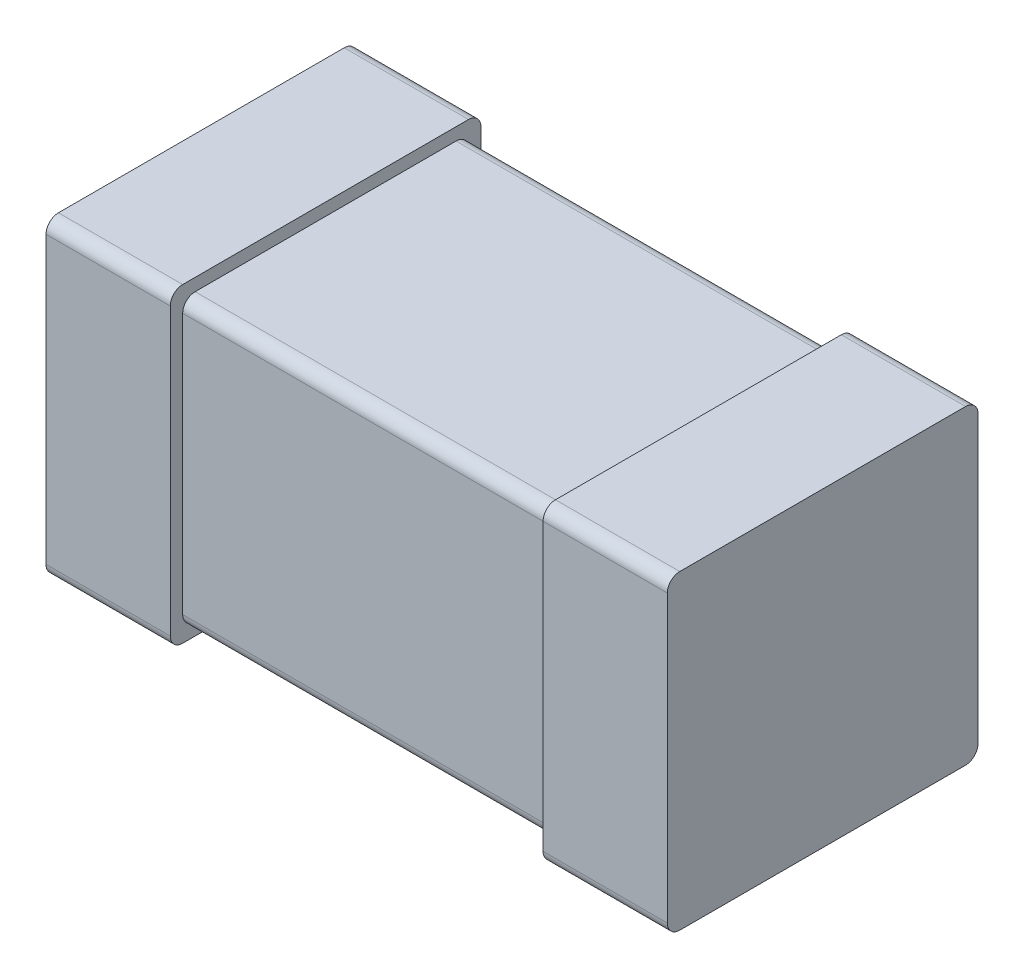
ISO-10303-21;
HEADER;
FILE_DESCRIPTION(('STEP AP214'),'2;1');
FILE_NAME('part.step','',(''),(''),'','','');
FILE_SCHEMA(('AUTOMOTIVE_DESIGN { 1 0 10303 214 1 1 1 1 }'));
ENDSEC;
DATA;
#1=APPLICATION_CONTEXT('core data for automotive mechanical design processes');
#2=APPLICATION_PROTOCOL_DEFINITION('international standard','automotive_design',2000,#1);
#3=PRODUCT_CONTEXT('',#1,'mechanical');
#4=PRODUCT('Part','Part','',(#3));
#5=PRODUCT_RELATED_PRODUCT_CATEGORY('part','',(#4));
#6=PRODUCT_DEFINITION_FORMATION('','',#4);
#7=PRODUCT_DEFINITION_CONTEXT('part definition',#1,'design');
#8=PRODUCT_DEFINITION('design','',#6,#7);
#9=PRODUCT_DEFINITION_SHAPE('','',#8);
#10=(LENGTH_UNIT() NAMED_UNIT(*) SI_UNIT(.MILLI.,.METRE.));
#11=(NAMED_UNIT(*) PLANE_ANGLE_UNIT() SI_UNIT($,.RADIAN.));
#12=(NAMED_UNIT(*) SI_UNIT($,.STERADIAN.) SOLID_ANGLE_UNIT());
#13=UNCERTAINTY_MEASURE_WITH_UNIT(LENGTH_MEASURE(1.E-05),#10,'distance_accuracy_value','');
#14=(GEOMETRIC_REPRESENTATION_CONTEXT(3) GLOBAL_UNCERTAINTY_ASSIGNED_CONTEXT((#13)) GLOBAL_UNIT_ASSIGNED_CONTEXT((#10,
#11,#12)) REPRESENTATION_CONTEXT('',''));
#15=CARTESIAN_POINT('',(0.,0.,0.));
#16=DIRECTION('',(0.,0.,1.));
#17=DIRECTION('',(1.,0.,0.));
#18=AXIS2_PLACEMENT_3D('',#15,#16,#17);
#19=CARTESIAN_POINT('',(0.5,-0.25,0.));
#20=DIRECTION('',(1.,0.,0.));
#21=DIRECTION('',(0.,1.,0.));
#22=AXIS2_PLACEMENT_3D('',#19,#20,#21);
#23=PLANE('',#22);
#24=DIRECTION('',(0.,0.,1.));
#25=VECTOR('',#24,1.);
#26=CARTESIAN_POINT('',(0.5,-0.25,0.));
#27=LINE('',#26,#25);
#28=CARTESIAN_POINT('',(0.5,-0.25,0.02));
#29=VERTEX_POINT('',#28);
#30=CARTESIAN_POINT('',(0.5,-0.25,0.48));
#31=VERTEX_POINT('',#30);
#32=EDGE_CURVE('E273',#29,#31,#27,.T.);
#33=ORIENTED_EDGE('',*,*,#32,.F.);
#34=CARTESIAN_POINT('',(0.5,-0.23,0.02));
#35=DIRECTION('',(1.,0.,0.));
#36=DIRECTION('',(0.,0.,1.));
#37=AXIS2_PLACEMENT_3D('',#34,#35,#36);
#38=CIRCLE('',#37,0.02);
#39=CARTESIAN_POINT('',(0.5,-0.23,0.));
#40=VERTEX_POINT('',#39);
#41=EDGE_CURVE('E291',#29,#40,#38,.T.);
#42=ORIENTED_EDGE('',*,*,#41,.T.);
#43=DIRECTION('',(0.,1.,0.));
#44=VECTOR('',#43,1.);
#45=CARTESIAN_POINT('',(0.5,-0.25,0.));
#46=LINE('',#45,#44);
#47=CARTESIAN_POINT('',(0.5,0.23,0.));
#48=VERTEX_POINT('',#47);
#49=EDGE_CURVE('E332',#40,#48,#46,.T.);
#50=ORIENTED_EDGE('',*,*,#49,.T.);
#51=CARTESIAN_POINT('',(0.5,0.23,0.02));
#52=DIRECTION('',(-1.,0.,0.));
#53=DIRECTION('',(0.,0.,1.));
#54=AXIS2_PLACEMENT_3D('',#51,#52,#53);
#55=CIRCLE('',#54,0.02);
#56=CARTESIAN_POINT('',(0.5,0.25,0.02));
#57=VERTEX_POINT('',#56);
#58=EDGE_CURVE('E480',#57,#48,#55,.T.);
#59=ORIENTED_EDGE('',*,*,#58,.F.);
#60=DIRECTION('',(0.,0.,1.));
#61=VECTOR('',#60,1.);
#62=CARTESIAN_POINT('',(0.5,0.25,0.));
#63=LINE('',#62,#61);
#64=CARTESIAN_POINT('',(0.5,0.25,0.48));
#65=VERTEX_POINT('',#64);
#66=EDGE_CURVE('E11',#57,#65,#63,.T.);
#67=ORIENTED_EDGE('',*,*,#66,.T.);
#68=CARTESIAN_POINT('',(0.5,0.23,0.48));
#69=DIRECTION('',(1.,0.,0.));
#70=DIRECTION('',(0.,0.,1.));
#71=AXIS2_PLACEMENT_3D('',#68,#69,#70);
#72=CIRCLE('',#71,0.02);
#73=CARTESIAN_POINT('',(0.5,0.23,0.5));
#74=VERTEX_POINT('',#73);
#75=EDGE_CURVE('E403',#65,#74,#72,.T.);
#76=ORIENTED_EDGE('',*,*,#75,.T.);
#77=DIRECTION('',(0.,1.,0.));
#78=VECTOR('',#77,1.);
#79=CARTESIAN_POINT('',(0.5,-0.25,0.5));
#80=LINE('',#79,#78);
#81=CARTESIAN_POINT('',(0.5,-0.23,0.5));
#82=VERTEX_POINT('',#81);
#83=EDGE_CURVE('E346',#82,#74,#80,.T.);
#84=ORIENTED_EDGE('',*,*,#83,.F.);
#85=CARTESIAN_POINT('',(0.5,-0.23,0.48));
#86=DIRECTION('',(-1.,0.,0.));
#87=DIRECTION('',(0.,0.,1.));
#88=AXIS2_PLACEMENT_3D('',#85,#86,#87);
#89=CIRCLE('',#88,0.02);
#90=EDGE_CURVE('E323',#31,#82,#89,.T.);
#91=ORIENTED_EDGE('',*,*,#90,.F.);
#92=EDGE_LOOP('',(#33,#42,#50,#59,#67,#76,#84,#91));
#93=FACE_BOUND('',#92,.T.);
#94=ADVANCED_FACE('F17',(#93),#23,.T.);
#95=CARTESIAN_POINT('',(0.3,0.25,0.));
#96=DIRECTION('',(0.,1.,0.));
#97=DIRECTION('',(1.,0.,0.));
#98=AXIS2_PLACEMENT_3D('',#95,#96,#97);
#99=PLANE('',#98);
#100=ORIENTED_EDGE('',*,*,#66,.F.);
#101=DIRECTION('',(1.,0.,0.));
#102=VECTOR('',#101,1.);
#103=CARTESIAN_POINT('',(0.3,0.25,0.02));
#104=LINE('',#103,#102);
#105=CARTESIAN_POINT('',(0.3,0.25,0.02));
#106=VERTEX_POINT('',#105);
#107=EDGE_CURVE('E254',#106,#57,#104,.T.);
#108=ORIENTED_EDGE('',*,*,#107,.F.);
#109=DIRECTION('',(0.,0.,1.));
#110=VECTOR('',#109,1.);
#111=CARTESIAN_POINT('',(0.3,0.25,0.));
#112=LINE('',#111,#110);
#113=CARTESIAN_POINT('',(0.3,0.25,0.48));
#114=VERTEX_POINT('',#113);
#115=EDGE_CURVE('E271',#106,#114,#112,.T.);
#116=ORIENTED_EDGE('',*,*,#115,.T.);
#117=DIRECTION('',(1.,0.,0.));
#118=VECTOR('',#117,1.);
#119=CARTESIAN_POINT('',(0.3,0.25,0.48));
#120=LINE('',#119,#118);
#121=EDGE_CURVE('E28',#114,#65,#120,.T.);
#122=ORIENTED_EDGE('',*,*,#121,.T.);
#123=EDGE_LOOP('',(#100,#108,#116,#122));
#124=FACE_BOUND('',#123,.T.);
#125=ADVANCED_FACE('F514',(#124),#99,.T.);
#126=CARTESIAN_POINT('',(0.3,0.23,0.48));
#127=DIRECTION('',(1.,0.,0.));
#128=DIRECTION('',(0.,1.,0.));
#129=AXIS2_PLACEMENT_3D('',#126,#127,#128);
#130=CYLINDRICAL_SURFACE('',#129,0.02);
#131=CARTESIAN_POINT('',(0.3,0.23,0.48));
#132=DIRECTION('',(1.,0.,0.));
#133=DIRECTION('',(0.,0.,1.));
#134=AXIS2_PLACEMENT_3D('',#131,#132,#133);
#135=CIRCLE('',#134,0.02);
#136=CARTESIAN_POINT('',(0.3,0.23,0.5));
#137=VERTEX_POINT('',#136);
#138=EDGE_CURVE('E267',#114,#137,#135,.T.);
#139=ORIENTED_EDGE('',*,*,#138,.T.);
#140=DIRECTION('',(1.,0.,0.));
#141=VECTOR('',#140,1.);
#142=CARTESIAN_POINT('',(0.3,0.23,0.5));
#143=LINE('',#142,#141);
#144=EDGE_CURVE('E347',#137,#74,#143,.T.);
#145=ORIENTED_EDGE('',*,*,#144,.T.);
#146=ORIENTED_EDGE('',*,*,#75,.F.);
#147=ORIENTED_EDGE('',*,*,#121,.F.);
#148=EDGE_LOOP('',(#139,#145,#146,#147));
#149=FACE_BOUND('',#148,.T.);
#150=ADVANCED_FACE('F512',(#149),#130,.T.);
#151=CARTESIAN_POINT('',(0.3,0.23,0.02));
#152=DIRECTION('',(1.,0.,0.));
#153=DIRECTION('',(0.,1.,0.));
#154=AXIS2_PLACEMENT_3D('',#151,#152,#153);
#155=CYLINDRICAL_SURFACE('',#154,0.02);
#156=ORIENTED_EDGE('',*,*,#107,.T.);
#157=ORIENTED_EDGE('',*,*,#58,.T.);
#158=DIRECTION('',(1.,0.,0.));
#159=VECTOR('',#158,1.);
#160=CARTESIAN_POINT('',(0.3,0.23,0.));
#161=LINE('',#160,#159);
#162=CARTESIAN_POINT('',(0.3,0.23,0.));
#163=VERTEX_POINT('',#162);
#164=EDGE_CURVE('E322',#163,#48,#161,.T.);
#165=ORIENTED_EDGE('',*,*,#164,.F.);
#166=CARTESIAN_POINT('',(0.3,0.23,0.02));
#167=DIRECTION('',(-1.,0.,0.));
#168=DIRECTION('',(0.,0.,1.));
#169=AXIS2_PLACEMENT_3D('',#166,#167,#168);
#170=CIRCLE('',#169,0.02);
#171=EDGE_CURVE('E465',#106,#163,#170,.T.);
#172=ORIENTED_EDGE('',*,*,#171,.F.);
#173=EDGE_LOOP('',(#156,#157,#165,#172));
#174=FACE_BOUND('',#173,.T.);
#175=ADVANCED_FACE('F521',(#174),#155,.T.);
#176=CARTESIAN_POINT('',(0.3,-0.25,0.5));
#177=DIRECTION('',(0.,0.,1.));
#178=DIRECTION('',(1.,0.,0.));
#179=AXIS2_PLACEMENT_3D('',#176,#177,#178);
#180=PLANE('',#179);
#181=DIRECTION('',(0.,1.,0.));
#182=VECTOR('',#181,1.);
#183=CARTESIAN_POINT('',(0.3,-0.25,0.5));
#184=LINE('',#183,#182);
#185=CARTESIAN_POINT('',(0.3,-0.23,0.5));
#186=VERTEX_POINT('',#185);
#187=EDGE_CURVE('E272',#186,#137,#184,.T.);
#188=ORIENTED_EDGE('',*,*,#187,.F.);
#189=DIRECTION('',(1.,0.,0.));
#190=VECTOR('',#189,1.);
#191=CARTESIAN_POINT('',(0.3,-0.23,0.5));
#192=LINE('',#191,#190);
#193=EDGE_CURVE('E319',#186,#82,#192,.T.);
#194=ORIENTED_EDGE('',*,*,#193,.T.);
#195=ORIENTED_EDGE('',*,*,#83,.T.);
#196=ORIENTED_EDGE('',*,*,#144,.F.);
#197=EDGE_LOOP('',(#188,#194,#195,#196));
#198=FACE_BOUND('',#197,.T.);
#199=ADVANCED_FACE('F509',(#198),#180,.T.);
#200=CARTESIAN_POINT('',(0.3,-0.25,0.));
#201=DIRECTION('',(0.,0.,1.));
#202=DIRECTION('',(1.,0.,0.));
#203=AXIS2_PLACEMENT_3D('',#200,#201,#202);
#204=PLANE('',#203);
#205=ORIENTED_EDGE('',*,*,#164,.T.);
#206=ORIENTED_EDGE('',*,*,#49,.F.);
#207=DIRECTION('',(1.,0.,0.));
#208=VECTOR('',#207,1.);
#209=CARTESIAN_POINT('',(0.3,-0.23,0.));
#210=LINE('',#209,#208);
#211=CARTESIAN_POINT('',(0.3,-0.23,0.));
#212=VERTEX_POINT('',#211);
#213=EDGE_CURVE('E277',#212,#40,#210,.T.);
#214=ORIENTED_EDGE('',*,*,#213,.F.);
#215=DIRECTION('',(0.,1.,0.));
#216=VECTOR('',#215,1.);
#217=CARTESIAN_POINT('',(0.3,-0.25,0.));
#218=LINE('',#217,#216);
#219=EDGE_CURVE('E452',#212,#163,#218,.T.);
#220=ORIENTED_EDGE('',*,*,#219,.T.);
#221=EDGE_LOOP('',(#205,#206,#214,#220));
#222=FACE_BOUND('',#221,.T.);
#223=ADVANCED_FACE('F524',(#222),#204,.F.);
#224=CARTESIAN_POINT('',(0.3,-0.23,0.48));
#225=DIRECTION('',(1.,0.,0.));
#226=DIRECTION('',(0.,-1.,0.));
#227=AXIS2_PLACEMENT_3D('',#224,#225,#226);
#228=CYLINDRICAL_SURFACE('',#227,0.02);
#229=DIRECTION('',(1.,0.,0.));
#230=VECTOR('',#229,1.);
#231=CARTESIAN_POINT('',(0.3,-0.25,0.48));
#232=LINE('',#231,#230);
#233=CARTESIAN_POINT('',(0.3,-0.25,0.48));
#234=VERTEX_POINT('',#233);
#235=EDGE_CURVE('E394',#234,#31,#232,.T.);
#236=ORIENTED_EDGE('',*,*,#235,.T.);
#237=ORIENTED_EDGE('',*,*,#90,.T.);
#238=ORIENTED_EDGE('',*,*,#193,.F.);
#239=CARTESIAN_POINT('',(0.3,-0.23,0.48));
#240=DIRECTION('',(-1.,0.,0.));
#241=DIRECTION('',(0.,0.,1.));
#242=AXIS2_PLACEMENT_3D('',#239,#240,#241);
#243=CIRCLE('',#242,0.02);
#244=EDGE_CURVE('E279',#234,#186,#243,.T.);
#245=ORIENTED_EDGE('',*,*,#244,.F.);
#246=EDGE_LOOP('',(#236,#237,#238,#245));
#247=FACE_BOUND('',#246,.T.);
#248=ADVANCED_FACE('F634',(#247),#228,.T.);
#249=CARTESIAN_POINT('',(0.3,-0.23,0.02));
#250=DIRECTION('',(1.,0.,0.));
#251=DIRECTION('',(0.,-1.,0.));
#252=AXIS2_PLACEMENT_3D('',#249,#250,#251);
#253=CYLINDRICAL_SURFACE('',#252,0.02);
#254=CARTESIAN_POINT('',(0.3,-0.23,0.02));
#255=DIRECTION('',(1.,0.,0.));
#256=DIRECTION('',(0.,0.,1.));
#257=AXIS2_PLACEMENT_3D('',#254,#255,#256);
#258=CIRCLE('',#257,0.02);
#259=CARTESIAN_POINT('',(0.3,-0.25,0.02));
#260=VERTEX_POINT('',#259);
#261=EDGE_CURVE('E448',#260,#212,#258,.T.);
#262=ORIENTED_EDGE('',*,*,#261,.T.);
#263=ORIENTED_EDGE('',*,*,#213,.T.);
#264=ORIENTED_EDGE('',*,*,#41,.F.);
#265=DIRECTION('',(1.,0.,0.));
#266=VECTOR('',#265,1.);
#267=CARTESIAN_POINT('',(0.3,-0.25,0.02));
#268=LINE('',#267,#266);
#269=EDGE_CURVE('E278',#260,#29,#268,.T.);
#270=ORIENTED_EDGE('',*,*,#269,.F.);
#271=EDGE_LOOP('',(#262,#263,#264,#270));
#272=FACE_BOUND('',#271,.T.);
#273=ADVANCED_FACE('F628',(#272),#253,.T.);
#274=CARTESIAN_POINT('',(0.3,-0.25,0.));
#275=DIRECTION('',(0.,1.,0.));
#276=DIRECTION('',(1.,0.,0.));
#277=AXIS2_PLACEMENT_3D('',#274,#275,#276);
#278=PLANE('',#277);
#279=ORIENTED_EDGE('',*,*,#235,.F.);
#280=DIRECTION('',(0.,0.,1.));
#281=VECTOR('',#280,1.);
#282=CARTESIAN_POINT('',(0.3,-0.25,0.));
#283=LINE('',#282,#281);
#284=EDGE_CURVE('E397',#260,#234,#283,.T.);
#285=ORIENTED_EDGE('',*,*,#284,.F.);
#286=ORIENTED_EDGE('',*,*,#269,.T.);
#287=ORIENTED_EDGE('',*,*,#32,.T.);
#288=EDGE_LOOP('',(#279,#285,#286,#287));
#289=FACE_BOUND('',#288,.T.);
#290=ADVANCED_FACE('F633',(#289),#278,.F.);
#291=CARTESIAN_POINT('',(0.3,-0.25,0.));
#292=DIRECTION('',(1.,0.,0.));
#293=DIRECTION('',(0.,1.,0.));
#294=AXIS2_PLACEMENT_3D('',#291,#292,#293);
#295=PLANE('',#294);
#296=DIRECTION('',(0.,1.,0.));
#297=VECTOR('',#296,1.);
#298=CARTESIAN_POINT('',(0.3,-0.23,0.02));
#299=LINE('',#298,#297);
#300=CARTESIAN_POINT('',(0.3,-0.21,0.02));
#301=VERTEX_POINT('',#300);
#302=CARTESIAN_POINT('',(0.3,0.21,0.02));
#303=VERTEX_POINT('',#302);
#304=EDGE_CURVE('E297',#301,#303,#299,.T.);
#305=ORIENTED_EDGE('',*,*,#304,.T.);
#306=CARTESIAN_POINT('',(0.3,0.21,0.04));
#307=DIRECTION('',(-1.,0.,0.));
#308=DIRECTION('',(0.,0.,1.));
#309=AXIS2_PLACEMENT_3D('',#306,#307,#308);
#310=CIRCLE('',#309,0.02);
#311=CARTESIAN_POINT('',(0.3,0.23,0.04));
#312=VERTEX_POINT('',#311);
#313=EDGE_CURVE('E296',#312,#303,#310,.T.);
#314=ORIENTED_EDGE('',*,*,#313,.F.);
#315=DIRECTION('',(0.,0.,1.));
#316=VECTOR('',#315,1.);
#317=CARTESIAN_POINT('',(0.3,0.23,0.02));
#318=LINE('',#317,#316);
#319=CARTESIAN_POINT('',(0.3,0.23,0.46));
#320=VERTEX_POINT('',#319);
#321=EDGE_CURVE('E385',#312,#320,#318,.T.);
#322=ORIENTED_EDGE('',*,*,#321,.T.);
#323=CARTESIAN_POINT('',(0.3,0.21,0.46));
#324=DIRECTION('',(1.,0.,0.));
#325=DIRECTION('',(0.,0.,1.));
#326=AXIS2_PLACEMENT_3D('',#323,#324,#325);
#327=CIRCLE('',#326,0.02);
#328=CARTESIAN_POINT('',(0.3,0.21,0.48));
#329=VERTEX_POINT('',#328);
#330=EDGE_CURVE('E301',#320,#329,#327,.T.);
#331=ORIENTED_EDGE('',*,*,#330,.T.);
#332=DIRECTION('',(0.,1.,0.));
#333=VECTOR('',#332,1.);
#334=CARTESIAN_POINT('',(0.3,-0.23,0.48));
#335=LINE('',#334,#333);
#336=CARTESIAN_POINT('',(0.3,-0.21,0.48));
#337=VERTEX_POINT('',#336);
#338=EDGE_CURVE('E438',#337,#329,#335,.T.);
#339=ORIENTED_EDGE('',*,*,#338,.F.);
#340=CARTESIAN_POINT('',(0.3,-0.21,0.46));
#341=DIRECTION('',(-1.,0.,0.));
#342=DIRECTION('',(0.,0.,1.));
#343=AXIS2_PLACEMENT_3D('',#340,#341,#342);
#344=CIRCLE('',#343,0.02);
#345=CARTESIAN_POINT('',(0.3,-0.23,0.46));
#346=VERTEX_POINT('',#345);
#347=EDGE_CURVE('E317',#346,#337,#344,.T.);
#348=ORIENTED_EDGE('',*,*,#347,.F.);
#349=DIRECTION('',(0.,0.,1.));
#350=VECTOR('',#349,1.);
#351=CARTESIAN_POINT('',(0.3,-0.23,0.02));
#352=LINE('',#351,#350);
#353=CARTESIAN_POINT('',(0.3,-0.23,0.04));
#354=VERTEX_POINT('',#353);
#355=EDGE_CURVE('E283',#354,#346,#352,.T.);
#356=ORIENTED_EDGE('',*,*,#355,.F.);
#357=CARTESIAN_POINT('',(0.3,-0.21,0.04));
#358=DIRECTION('',(1.,0.,0.));
#359=DIRECTION('',(0.,0.,1.));
#360=AXIS2_PLACEMENT_3D('',#357,#358,#359);
#361=CIRCLE('',#360,0.02);
#362=EDGE_CURVE('E393',#354,#301,#361,.T.);
#363=ORIENTED_EDGE('',*,*,#362,.T.);
#364=EDGE_LOOP('',(#305,#314,#322,#331,#339,#348,#356,#363));
#365=FACE_BOUND('',#364,.T.);
#366=ORIENTED_EDGE('',*,*,#244,.T.);
#367=ORIENTED_EDGE('',*,*,#187,.T.);
#368=ORIENTED_EDGE('',*,*,#138,.F.);
#369=ORIENTED_EDGE('',*,*,#115,.F.);
#370=ORIENTED_EDGE('',*,*,#171,.T.);
#371=ORIENTED_EDGE('',*,*,#219,.F.);
#372=ORIENTED_EDGE('',*,*,#261,.F.);
#373=ORIENTED_EDGE('',*,*,#284,.T.);
#374=EDGE_LOOP('',(#366,#367,#368,#369,#370,#371,#372,#373));
#375=FACE_BOUND('',#374,.T.);
#376=ADVANCED_FACE('F504',(#365,#375),#295,.F.);
#377=CARTESIAN_POINT('',(-0.3,-0.23,0.02));
#378=DIRECTION('',(0.,1.,0.));
#379=DIRECTION('',(1.,0.,0.));
#380=AXIS2_PLACEMENT_3D('',#377,#378,#379);
#381=PLANE('',#380);
#382=DIRECTION('',(1.,0.,0.));
#383=VECTOR('',#382,1.);
#384=CARTESIAN_POINT('',(-0.3,-0.23,0.46));
#385=LINE('',#384,#383);
#386=CARTESIAN_POINT('',(-0.3,-0.23,0.46));
#387=VERTEX_POINT('',#386);
#388=EDGE_CURVE('E21',#387,#346,#385,.T.);
#389=ORIENTED_EDGE('',*,*,#388,.F.);
#390=DIRECTION('',(0.,0.,1.));
#391=VECTOR('',#390,1.);
#392=CARTESIAN_POINT('',(-0.3,-0.23,0.02));
#393=LINE('',#392,#391);
#394=CARTESIAN_POINT('',(-0.3,-0.23,0.04));
#395=VERTEX_POINT('',#394);
#396=EDGE_CURVE('E310',#395,#387,#393,.T.);
#397=ORIENTED_EDGE('',*,*,#396,.F.);
#398=DIRECTION('',(1.,0.,0.));
#399=VECTOR('',#398,1.);
#400=CARTESIAN_POINT('',(-0.3,-0.23,0.04));
#401=LINE('',#400,#399);
#402=EDGE_CURVE('E444',#395,#354,#401,.T.);
#403=ORIENTED_EDGE('',*,*,#402,.T.);
#404=ORIENTED_EDGE('',*,*,#355,.T.);
#405=EDGE_LOOP('',(#389,#397,#403,#404));
#406=FACE_BOUND('',#405,.T.);
#407=ADVANCED_FACE('F643',(#406),#381,.F.);
#408=CARTESIAN_POINT('',(-0.3,-0.21,0.46));
#409=DIRECTION('',(1.,0.,0.));
#410=DIRECTION('',(0.,-1.,0.));
#411=AXIS2_PLACEMENT_3D('',#408,#409,#410);
#412=CYLINDRICAL_SURFACE('',#411,0.02);
#413=ORIENTED_EDGE('',*,*,#388,.T.);
#414=ORIENTED_EDGE('',*,*,#347,.T.);
#415=DIRECTION('',(1.,0.,0.));
#416=VECTOR('',#415,1.);
#417=CARTESIAN_POINT('',(-0.3,-0.21,0.48));
#418=LINE('',#417,#416);
#419=CARTESIAN_POINT('',(-0.3,-0.21,0.48));
#420=VERTEX_POINT('',#419);
#421=EDGE_CURVE('E146',#420,#337,#418,.T.);
#422=ORIENTED_EDGE('',*,*,#421,.F.);
#423=CARTESIAN_POINT('',(-0.3,-0.21,0.46));
#424=DIRECTION('',(-1.,0.,0.));
#425=DIRECTION('',(0.,0.,1.));
#426=AXIS2_PLACEMENT_3D('',#423,#424,#425);
#427=CIRCLE('',#426,0.02);
#428=EDGE_CURVE('E314',#387,#420,#427,.T.);
#429=ORIENTED_EDGE('',*,*,#428,.F.);
#430=EDGE_LOOP('',(#413,#414,#422,#429));
#431=FACE_BOUND('',#430,.T.);
#432=ADVANCED_FACE('F569',(#431),#412,.T.);
#433=CARTESIAN_POINT('',(-0.3,-0.23,0.48));
#434=DIRECTION('',(0.,0.,1.));
#435=DIRECTION('',(1.,0.,0.));
#436=AXIS2_PLACEMENT_3D('',#433,#434,#435);
#437=PLANE('',#436);
#438=DIRECTION('',(0.,1.,0.));
#439=VECTOR('',#438,1.);
#440=CARTESIAN_POINT('',(-0.3,-0.23,0.48));
#441=LINE('',#440,#439);
#442=CARTESIAN_POINT('',(-0.3,0.21,0.48));
#443=VERTEX_POINT('',#442);
#444=EDGE_CURVE('E378',#420,#443,#441,.T.);
#445=ORIENTED_EDGE('',*,*,#444,.F.);
#446=ORIENTED_EDGE('',*,*,#421,.T.);
#447=ORIENTED_EDGE('',*,*,#338,.T.);
#448=DIRECTION('',(1.,0.,0.));
#449=VECTOR('',#448,1.);
#450=CARTESIAN_POINT('',(-0.3,0.21,0.48));
#451=LINE('',#450,#449);
#452=EDGE_CURVE('E298',#443,#329,#451,.T.);
#453=ORIENTED_EDGE('',*,*,#452,.F.);
#454=EDGE_LOOP('',(#445,#446,#447,#453));
#455=FACE_BOUND('',#454,.T.);
#456=ADVANCED_FACE('F19',(#455),#437,.T.);
#457=CARTESIAN_POINT('',(-0.3,0.21,0.46));
#458=DIRECTION('',(1.,0.,0.));
#459=DIRECTION('',(0.,1.,0.));
#460=AXIS2_PLACEMENT_3D('',#457,#458,#459);
#461=CYLINDRICAL_SURFACE('',#460,0.02);
#462=CARTESIAN_POINT('',(-0.3,0.21,0.46));
#463=DIRECTION('',(1.,0.,0.));
#464=DIRECTION('',(0.,0.,1.));
#465=AXIS2_PLACEMENT_3D('',#462,#463,#464);
#466=CIRCLE('',#465,0.02);
#467=CARTESIAN_POINT('',(-0.3,0.23,0.46));
#468=VERTEX_POINT('',#467);
#469=EDGE_CURVE('E375',#468,#443,#466,.T.);
#470=ORIENTED_EDGE('',*,*,#469,.T.);
#471=ORIENTED_EDGE('',*,*,#452,.T.);
#472=ORIENTED_EDGE('',*,*,#330,.F.);
#473=DIRECTION('',(1.,0.,0.));
#474=VECTOR('',#473,1.);
#475=CARTESIAN_POINT('',(-0.3,0.23,0.46));
#476=LINE('',#475,#474);
#477=EDGE_CURVE('E302',#468,#320,#476,.T.);
#478=ORIENTED_EDGE('',*,*,#477,.F.);
#479=EDGE_LOOP('',(#470,#471,#472,#478));
#480=FACE_BOUND('',#479,.T.);
#481=ADVANCED_FACE('F562',(#480),#461,.T.);
#482=CARTESIAN_POINT('',(-0.3,0.23,0.02));
#483=DIRECTION('',(0.,1.,0.));
#484=DIRECTION('',(1.,0.,0.));
#485=AXIS2_PLACEMENT_3D('',#482,#483,#484);
#486=PLANE('',#485);
#487=ORIENTED_EDGE('',*,*,#321,.F.);
#488=DIRECTION('',(1.,0.,0.));
#489=VECTOR('',#488,1.);
#490=CARTESIAN_POINT('',(-0.3,0.23,0.04));
#491=LINE('',#490,#489);
#492=CARTESIAN_POINT('',(-0.3,0.23,0.04));
#493=VERTEX_POINT('',#492);
#494=EDGE_CURVE('E292',#493,#312,#491,.T.);
#495=ORIENTED_EDGE('',*,*,#494,.F.);
#496=DIRECTION('',(0.,0.,1.));
#497=VECTOR('',#496,1.);
#498=CARTESIAN_POINT('',(-0.3,0.23,0.02));
#499=LINE('',#498,#497);
#500=EDGE_CURVE('E266',#493,#468,#499,.T.);
#501=ORIENTED_EDGE('',*,*,#500,.T.);
#502=ORIENTED_EDGE('',*,*,#477,.T.);
#503=EDGE_LOOP('',(#487,#495,#501,#502));
#504=FACE_BOUND('',#503,.T.);
#505=ADVANCED_FACE('F550',(#504),#486,.T.);
#506=CARTESIAN_POINT('',(-0.3,0.21,0.04));
#507=DIRECTION('',(1.,0.,0.));
#508=DIRECTION('',(0.,1.,0.));
#509=AXIS2_PLACEMENT_3D('',#506,#507,#508);
#510=CYLINDRICAL_SURFACE('',#509,0.02);
#511=ORIENTED_EDGE('',*,*,#494,.T.);
#512=ORIENTED_EDGE('',*,*,#313,.T.);
#513=DIRECTION('',(1.,0.,0.));
#514=VECTOR('',#513,1.);
#515=CARTESIAN_POINT('',(-0.3,0.21,0.02));
#516=LINE('',#515,#514);
#517=CARTESIAN_POINT('',(-0.3,0.21,0.02));
#518=VERTEX_POINT('',#517);
#519=EDGE_CURVE('E437',#518,#303,#516,.T.);
#520=ORIENTED_EDGE('',*,*,#519,.F.);
#521=CARTESIAN_POINT('',(-0.3,0.21,0.04));
#522=DIRECTION('',(-1.,0.,0.));
#523=DIRECTION('',(0.,0.,1.));
#524=AXIS2_PLACEMENT_3D('',#521,#522,#523);
#525=CIRCLE('',#524,0.02);
#526=EDGE_CURVE('E261',#493,#518,#525,.T.);
#527=ORIENTED_EDGE('',*,*,#526,.F.);
#528=EDGE_LOOP('',(#511,#512,#520,#527));
#529=FACE_BOUND('',#528,.T.);
#530=ADVANCED_FACE('F554',(#529),#510,.T.);
#531=CARTESIAN_POINT('',(-0.3,-0.23,0.02));
#532=DIRECTION('',(0.,0.,1.));
#533=DIRECTION('',(1.,0.,0.));
#534=AXIS2_PLACEMENT_3D('',#531,#532,#533);
#535=PLANE('',#534);
#536=ORIENTED_EDGE('',*,*,#519,.T.);
#537=ORIENTED_EDGE('',*,*,#304,.F.);
#538=DIRECTION('',(1.,0.,0.));
#539=VECTOR('',#538,1.);
#540=CARTESIAN_POINT('',(-0.3,-0.21,0.02));
#541=LINE('',#540,#539);
#542=CARTESIAN_POINT('',(-0.3,-0.21,0.02));
#543=VERTEX_POINT('',#542);
#544=EDGE_CURVE('E389',#543,#301,#541,.T.);
#545=ORIENTED_EDGE('',*,*,#544,.F.);
#546=DIRECTION('',(0.,1.,0.));
#547=VECTOR('',#546,1.);
#548=CARTESIAN_POINT('',(-0.3,-0.23,0.02));
#549=LINE('',#548,#547);
#550=EDGE_CURVE('E265',#543,#518,#549,.T.);
#551=ORIENTED_EDGE('',*,*,#550,.T.);
#552=EDGE_LOOP('',(#536,#537,#545,#551));
#553=FACE_BOUND('',#552,.T.);
#554=ADVANCED_FACE('F693',(#553),#535,.F.);
#555=CARTESIAN_POINT('',(-0.3,-0.21,0.04));
#556=DIRECTION('',(1.,0.,0.));
#557=DIRECTION('',(0.,-1.,0.));
#558=AXIS2_PLACEMENT_3D('',#555,#556,#557);
#559=CYLINDRICAL_SURFACE('',#558,0.02);
#560=CARTESIAN_POINT('',(-0.3,-0.21,0.04));
#561=DIRECTION('',(1.,0.,0.));
#562=DIRECTION('',(0.,0.,1.));
#563=AXIS2_PLACEMENT_3D('',#560,#561,#562);
#564=CIRCLE('',#563,0.02);
#565=EDGE_CURVE('E287',#395,#543,#564,.T.);
#566=ORIENTED_EDGE('',*,*,#565,.T.);
#567=ORIENTED_EDGE('',*,*,#544,.T.);
#568=ORIENTED_EDGE('',*,*,#362,.F.);
#569=ORIENTED_EDGE('',*,*,#402,.F.);
#570=EDGE_LOOP('',(#566,#567,#568,#569));
#571=FACE_BOUND('',#570,.T.);
#572=ADVANCED_FACE('F688',(#571),#559,.T.);
#573=CARTESIAN_POINT('',(-0.3,-0.25,0.));
#574=DIRECTION('',(1.,0.,0.));
#575=DIRECTION('',(0.,1.,0.));
#576=AXIS2_PLACEMENT_3D('',#573,#574,#575);
#577=PLANE('',#576);
#578=ORIENTED_EDGE('',*,*,#565,.F.);
#579=ORIENTED_EDGE('',*,*,#396,.T.);
#580=ORIENTED_EDGE('',*,*,#428,.T.);
#581=ORIENTED_EDGE('',*,*,#444,.T.);
#582=ORIENTED_EDGE('',*,*,#469,.F.);
#583=ORIENTED_EDGE('',*,*,#500,.F.);
#584=ORIENTED_EDGE('',*,*,#526,.T.);
#585=ORIENTED_EDGE('',*,*,#550,.F.);
#586=EDGE_LOOP('',(#578,#579,#580,#581,#582,#583,#584,#585));
#587=FACE_BOUND('',#586,.T.);
#588=DIRECTION('',(0.,0.,1.));
#589=VECTOR('',#588,1.);
#590=CARTESIAN_POINT('',(-0.3,-0.25,0.));
#591=LINE('',#590,#589);
#592=CARTESIAN_POINT('',(-0.3,-0.25,0.02));
#593=VERTEX_POINT('',#592);
#594=CARTESIAN_POINT('',(-0.3,-0.25,0.48));
#595=VERTEX_POINT('',#594);
#596=EDGE_CURVE('E224',#593,#595,#591,.T.);
#597=ORIENTED_EDGE('',*,*,#596,.F.);
#598=CARTESIAN_POINT('',(-0.3,-0.23,0.02));
#599=DIRECTION('',(1.,0.,0.));
#600=DIRECTION('',(0.,0.,1.));
#601=AXIS2_PLACEMENT_3D('',#598,#599,#600);
#602=CIRCLE('',#601,0.02);
#603=CARTESIAN_POINT('',(-0.3,-0.23,0.));
#604=VERTEX_POINT('',#603);
#605=EDGE_CURVE('E384',#593,#604,#602,.T.);
#606=ORIENTED_EDGE('',*,*,#605,.T.);
#607=DIRECTION('',(0.,1.,0.));
#608=VECTOR('',#607,1.);
#609=CARTESIAN_POINT('',(-0.3,-0.25,0.));
#610=LINE('',#609,#608);
#611=CARTESIAN_POINT('',(-0.3,0.23,0.));
#612=VERTEX_POINT('',#611);
#613=EDGE_CURVE('E365',#604,#612,#610,.T.);
#614=ORIENTED_EDGE('',*,*,#613,.T.);
#615=CARTESIAN_POINT('',(-0.3,0.23,0.02));
#616=DIRECTION('',(-1.,0.,0.));
#617=DIRECTION('',(0.,0.,1.));
#618=AXIS2_PLACEMENT_3D('',#615,#616,#617);
#619=CIRCLE('',#618,0.02);
#620=CARTESIAN_POINT('',(-0.3,0.25,0.02));
#621=VERTEX_POINT('',#620);
#622=EDGE_CURVE('E259',#621,#612,#619,.T.);
#623=ORIENTED_EDGE('',*,*,#622,.F.);
#624=DIRECTION('',(0.,0.,1.));
#625=VECTOR('',#624,1.);
#626=CARTESIAN_POINT('',(-0.3,0.25,0.));
#627=LINE('',#626,#625);
#628=CARTESIAN_POINT('',(-0.3,0.25,0.48));
#629=VERTEX_POINT('',#628);
#630=EDGE_CURVE('E284',#621,#629,#627,.T.);
#631=ORIENTED_EDGE('',*,*,#630,.T.);
#632=CARTESIAN_POINT('',(-0.3,0.23,0.48));
#633=DIRECTION('',(1.,0.,0.));
#634=DIRECTION('',(0.,0.,1.));
#635=AXIS2_PLACEMENT_3D('',#632,#633,#634);
#636=CIRCLE('',#635,0.02);
#637=CARTESIAN_POINT('',(-0.3,0.23,0.5));
#638=VERTEX_POINT('',#637);
#639=EDGE_CURVE('E366',#629,#638,#636,.T.);
#640=ORIENTED_EDGE('',*,*,#639,.T.);
#641=DIRECTION('',(0.,1.,0.));
#642=VECTOR('',#641,1.);
#643=CARTESIAN_POINT('',(-0.3,-0.25,0.5));
#644=LINE('',#643,#642);
#645=CARTESIAN_POINT('',(-0.3,-0.23,0.5));
#646=VERTEX_POINT('',#645);
#647=EDGE_CURVE('E362',#646,#638,#644,.T.);
#648=ORIENTED_EDGE('',*,*,#647,.F.);
#649=CARTESIAN_POINT('',(-0.3,-0.23,0.48));
#650=DIRECTION('',(-1.,0.,0.));
#651=DIRECTION('',(0.,0.,1.));
#652=AXIS2_PLACEMENT_3D('',#649,#650,#651);
#653=CIRCLE('',#652,0.02);
#654=EDGE_CURVE('E407',#595,#646,#653,.T.);
#655=ORIENTED_EDGE('',*,*,#654,.F.);
#656=EDGE_LOOP('',(#597,#606,#614,#623,#631,#640,#648,#655));
#657=FACE_BOUND('',#656,.T.);
#658=ADVANCED_FACE('F419',(#587,#657),#577,.T.);
#659=CARTESIAN_POINT('',(-0.5,0.25,0.));
#660=DIRECTION('',(0.,1.,0.));
#661=DIRECTION('',(1.,0.,0.));
#662=AXIS2_PLACEMENT_3D('',#659,#660,#661);
#663=PLANE('',#662);
#664=ORIENTED_EDGE('',*,*,#630,.F.);
#665=DIRECTION('',(1.,0.,0.));
#666=VECTOR('',#665,1.);
#667=CARTESIAN_POINT('',(-0.5,0.25,0.02));
#668=LINE('',#667,#666);
#669=CARTESIAN_POINT('',(-0.5,0.25,0.02));
#670=VERTEX_POINT('',#669);
#671=EDGE_CURVE('E181',#670,#621,#668,.T.);
#672=ORIENTED_EDGE('',*,*,#671,.F.);
#673=DIRECTION('',(0.,0.,1.));
#674=VECTOR('',#673,1.);
#675=CARTESIAN_POINT('',(-0.5,0.25,0.));
#676=LINE('',#675,#674);
#677=CARTESIAN_POINT('',(-0.5,0.25,0.48));
#678=VERTEX_POINT('',#677);
#679=EDGE_CURVE('E309',#670,#678,#676,.T.);
#680=ORIENTED_EDGE('',*,*,#679,.T.);
#681=DIRECTION('',(1.,0.,0.));
#682=VECTOR('',#681,1.);
#683=CARTESIAN_POINT('',(-0.5,0.25,0.48));
#684=LINE('',#683,#682);
#685=EDGE_CURVE('E193',#678,#629,#684,.T.);
#686=ORIENTED_EDGE('',*,*,#685,.T.);
#687=EDGE_LOOP('',(#664,#672,#680,#686));
#688=FACE_BOUND('',#687,.T.);
#689=ADVANCED_FACE('F411',(#688),#663,.T.);
#690=CARTESIAN_POINT('',(-0.5,0.23,0.48));
#691=DIRECTION('',(1.,0.,0.));
#692=DIRECTION('',(0.,1.,0.));
#693=AXIS2_PLACEMENT_3D('',#690,#691,#692);
#694=CYLINDRICAL_SURFACE('',#693,0.02);
#695=CARTESIAN_POINT('',(-0.5,0.23,0.48));
#696=DIRECTION('',(1.,0.,0.));
#697=DIRECTION('',(0.,0.,1.));
#698=AXIS2_PLACEMENT_3D('',#695,#696,#697);
#699=CIRCLE('',#698,0.02);
#700=CARTESIAN_POINT('',(-0.5,0.23,0.5));
#701=VERTEX_POINT('',#700);
#702=EDGE_CURVE('E251',#678,#701,#699,.T.);
#703=ORIENTED_EDGE('',*,*,#702,.T.);
#704=DIRECTION('',(1.,0.,0.));
#705=VECTOR('',#704,1.);
#706=CARTESIAN_POINT('',(-0.5,0.23,0.5));
#707=LINE('',#706,#705);
#708=EDGE_CURVE('E260',#701,#638,#707,.T.);
#709=ORIENTED_EDGE('',*,*,#708,.T.);
#710=ORIENTED_EDGE('',*,*,#639,.F.);
#711=ORIENTED_EDGE('',*,*,#685,.F.);
#712=EDGE_LOOP('',(#703,#709,#710,#711));
#713=FACE_BOUND('',#712,.T.);
#714=ADVANCED_FACE('F416',(#713),#694,.T.);
#715=CARTESIAN_POINT('',(-0.5,0.23,0.02));
#716=DIRECTION('',(1.,0.,0.));
#717=DIRECTION('',(0.,1.,0.));
#718=AXIS2_PLACEMENT_3D('',#715,#716,#717);
#719=CYLINDRICAL_SURFACE('',#718,0.02);
#720=ORIENTED_EDGE('',*,*,#671,.T.);
#721=ORIENTED_EDGE('',*,*,#622,.T.);
#722=DIRECTION('',(1.,0.,0.));
#723=VECTOR('',#722,1.);
#724=CARTESIAN_POINT('',(-0.5,0.23,0.));
#725=LINE('',#724,#723);
#726=CARTESIAN_POINT('',(-0.5,0.23,0.));
#727=VERTEX_POINT('',#726);
#728=EDGE_CURVE('E372',#727,#612,#725,.T.);
#729=ORIENTED_EDGE('',*,*,#728,.F.);
#730=CARTESIAN_POINT('',(-0.5,0.23,0.02));
#731=DIRECTION('',(-1.,0.,0.));
#732=DIRECTION('',(0.,0.,1.));
#733=AXIS2_PLACEMENT_3D('',#730,#731,#732);
#734=CIRCLE('',#733,0.02);
#735=EDGE_CURVE('E304',#670,#727,#734,.T.);
#736=ORIENTED_EDGE('',*,*,#735,.F.);
#737=EDGE_LOOP('',(#720,#721,#729,#736));
#738=FACE_BOUND('',#737,.T.);
#739=ADVANCED_FACE('F427',(#738),#719,.T.);
#740=CARTESIAN_POINT('',(-0.5,-0.25,0.5));
#741=DIRECTION('',(0.,0.,1.));
#742=DIRECTION('',(1.,0.,0.));
#743=AXIS2_PLACEMENT_3D('',#740,#741,#742);
#744=PLANE('',#743);
#745=DIRECTION('',(0.,1.,0.));
#746=VECTOR('',#745,1.);
#747=CARTESIAN_POINT('',(-0.5,-0.25,0.5));
#748=LINE('',#747,#746);
#749=CARTESIAN_POINT('',(-0.5,-0.23,0.5));
#750=VERTEX_POINT('',#749);
#751=EDGE_CURVE('E246',#750,#701,#748,.T.);
#752=ORIENTED_EDGE('',*,*,#751,.F.);
#753=DIRECTION('',(1.,0.,0.));
#754=VECTOR('',#753,1.);
#755=CARTESIAN_POINT('',(-0.5,-0.23,0.5));
#756=LINE('',#755,#754);
#757=EDGE_CURVE('E243',#750,#646,#756,.T.);
#758=ORIENTED_EDGE('',*,*,#757,.T.);
#759=ORIENTED_EDGE('',*,*,#647,.T.);
#760=ORIENTED_EDGE('',*,*,#708,.F.);
#761=EDGE_LOOP('',(#752,#758,#759,#760));
#762=FACE_BOUND('',#761,.T.);
#763=ADVANCED_FACE('F611',(#762),#744,.T.);
#764=CARTESIAN_POINT('',(-0.5,-0.25,0.));
#765=DIRECTION('',(0.,0.,1.));
#766=DIRECTION('',(1.,0.,0.));
#767=AXIS2_PLACEMENT_3D('',#764,#765,#766);
#768=PLANE('',#767);
#769=ORIENTED_EDGE('',*,*,#728,.T.);
#770=ORIENTED_EDGE('',*,*,#613,.F.);
#771=DIRECTION('',(1.,0.,0.));
#772=VECTOR('',#771,1.);
#773=CARTESIAN_POINT('',(-0.5,-0.23,0.));
#774=LINE('',#773,#772);
#775=CARTESIAN_POINT('',(-0.5,-0.23,0.));
#776=VERTEX_POINT('',#775);
#777=EDGE_CURVE('E380',#776,#604,#774,.T.);
#778=ORIENTED_EDGE('',*,*,#777,.F.);
#779=DIRECTION('',(0.,1.,0.));
#780=VECTOR('',#779,1.);
#781=CARTESIAN_POINT('',(-0.5,-0.25,0.));
#782=LINE('',#781,#780);
#783=EDGE_CURVE('E308',#776,#727,#782,.T.);
#784=ORIENTED_EDGE('',*,*,#783,.T.);
#785=EDGE_LOOP('',(#769,#770,#778,#784));
#786=FACE_BOUND('',#785,.T.);
#787=ADVANCED_FACE('F536',(#786),#768,.F.);
#788=CARTESIAN_POINT('',(-0.5,-0.23,0.48));
#789=DIRECTION('',(1.,0.,0.));
#790=DIRECTION('',(0.,-1.,0.));
#791=AXIS2_PLACEMENT_3D('',#788,#789,#790);
#792=CYLINDRICAL_SURFACE('',#791,0.02);
#793=DIRECTION('',(1.,0.,0.));
#794=VECTOR('',#793,1.);
#795=CARTESIAN_POINT('',(-0.5,-0.25,0.48));
#796=LINE('',#795,#794);
#797=CARTESIAN_POINT('',(-0.5,-0.25,0.48));
#798=VERTEX_POINT('',#797);
#799=EDGE_CURVE('E217',#798,#595,#796,.T.);
#800=ORIENTED_EDGE('',*,*,#799,.T.);
#801=ORIENTED_EDGE('',*,*,#654,.T.);
#802=ORIENTED_EDGE('',*,*,#757,.F.);
#803=CARTESIAN_POINT('',(-0.5,-0.23,0.48));
#804=DIRECTION('',(-1.,0.,0.));
#805=DIRECTION('',(0.,0.,1.));
#806=AXIS2_PLACEMENT_3D('',#803,#804,#805);
#807=CIRCLE('',#806,0.02);
#808=EDGE_CURVE('E235',#798,#750,#807,.T.);
#809=ORIENTED_EDGE('',*,*,#808,.F.);
#810=EDGE_LOOP('',(#800,#801,#802,#809));
#811=FACE_BOUND('',#810,.T.);
#812=ADVANCED_FACE('F241',(#811),#792,.T.);
#813=CARTESIAN_POINT('',(-0.5,-0.23,0.02));
#814=DIRECTION('',(1.,0.,0.));
#815=DIRECTION('',(0.,-1.,0.));
#816=AXIS2_PLACEMENT_3D('',#813,#814,#815);
#817=CYLINDRICAL_SURFACE('',#816,0.02);
#818=CARTESIAN_POINT('',(-0.5,-0.23,0.02));
#819=DIRECTION('',(1.,0.,0.));
#820=DIRECTION('',(0.,0.,1.));
#821=AXIS2_PLACEMENT_3D('',#818,#819,#820);
#822=CIRCLE('',#821,0.02);
#823=CARTESIAN_POINT('',(-0.5,-0.25,0.02));
#824=VERTEX_POINT('',#823);
#825=EDGE_CURVE('E238',#824,#776,#822,.T.);
#826=ORIENTED_EDGE('',*,*,#825,.T.);
#827=ORIENTED_EDGE('',*,*,#777,.T.);
#828=ORIENTED_EDGE('',*,*,#605,.F.);
#829=DIRECTION('',(1.,0.,0.));
#830=VECTOR('',#829,1.);
#831=CARTESIAN_POINT('',(-0.5,-0.25,0.02));
#832=LINE('',#831,#830);
#833=EDGE_CURVE('E229',#824,#593,#832,.T.);
#834=ORIENTED_EDGE('',*,*,#833,.F.);
#835=EDGE_LOOP('',(#826,#827,#828,#834));
#836=FACE_BOUND('',#835,.T.);
#837=ADVANCED_FACE('F577',(#836),#817,.T.);
#838=CARTESIAN_POINT('',(-0.5,-0.25,0.));
#839=DIRECTION('',(0.,1.,0.));
#840=DIRECTION('',(1.,0.,0.));
#841=AXIS2_PLACEMENT_3D('',#838,#839,#840);
#842=PLANE('',#841);
#843=ORIENTED_EDGE('',*,*,#799,.F.);
#844=DIRECTION('',(0.,0.,1.));
#845=VECTOR('',#844,1.);
#846=CARTESIAN_POINT('',(-0.5,-0.25,0.));
#847=LINE('',#846,#845);
#848=EDGE_CURVE('E221',#824,#798,#847,.T.);
#849=ORIENTED_EDGE('',*,*,#848,.F.);
#850=ORIENTED_EDGE('',*,*,#833,.T.);
#851=ORIENTED_EDGE('',*,*,#596,.T.);
#852=EDGE_LOOP('',(#843,#849,#850,#851));
#853=FACE_BOUND('',#852,.T.);
#854=ADVANCED_FACE('F219',(#853),#842,.F.);
#855=CARTESIAN_POINT('',(-0.5,-0.25,0.));
#856=DIRECTION('',(1.,0.,0.));
#857=DIRECTION('',(0.,1.,0.));
#858=AXIS2_PLACEMENT_3D('',#855,#856,#857);
#859=PLANE('',#858);
#860=ORIENTED_EDGE('',*,*,#808,.T.);
#861=ORIENTED_EDGE('',*,*,#751,.T.);
#862=ORIENTED_EDGE('',*,*,#702,.F.);
#863=ORIENTED_EDGE('',*,*,#679,.F.);
#864=ORIENTED_EDGE('',*,*,#735,.T.);
#865=ORIENTED_EDGE('',*,*,#783,.F.);
#866=ORIENTED_EDGE('',*,*,#825,.F.);
#867=ORIENTED_EDGE('',*,*,#848,.T.);
#868=EDGE_LOOP('',(#860,#861,#862,#863,#864,#865,#866,#867));
#869=FACE_BOUND('',#868,.T.);
#870=ADVANCED_FACE('F233',(#869),#859,.F.);
#871=CLOSED_SHELL('',(#94,#125,#150,#175,#199,#223,#248,#273,#290,#376,#407,#432,#456,#481,#505,
#530,#554,#572,#658,#689,#714,#739,#763,#787,#812,#837,#854,#870));
#872=MANIFOLD_SOLID_BREP('B1',#871);
#873=ADVANCED_BREP_SHAPE_REPRESENTATION('',(#18,#872),#14);
#874=SHAPE_DEFINITION_REPRESENTATION(#9,#873);
ENDSEC;
END-ISO-10303-21;
